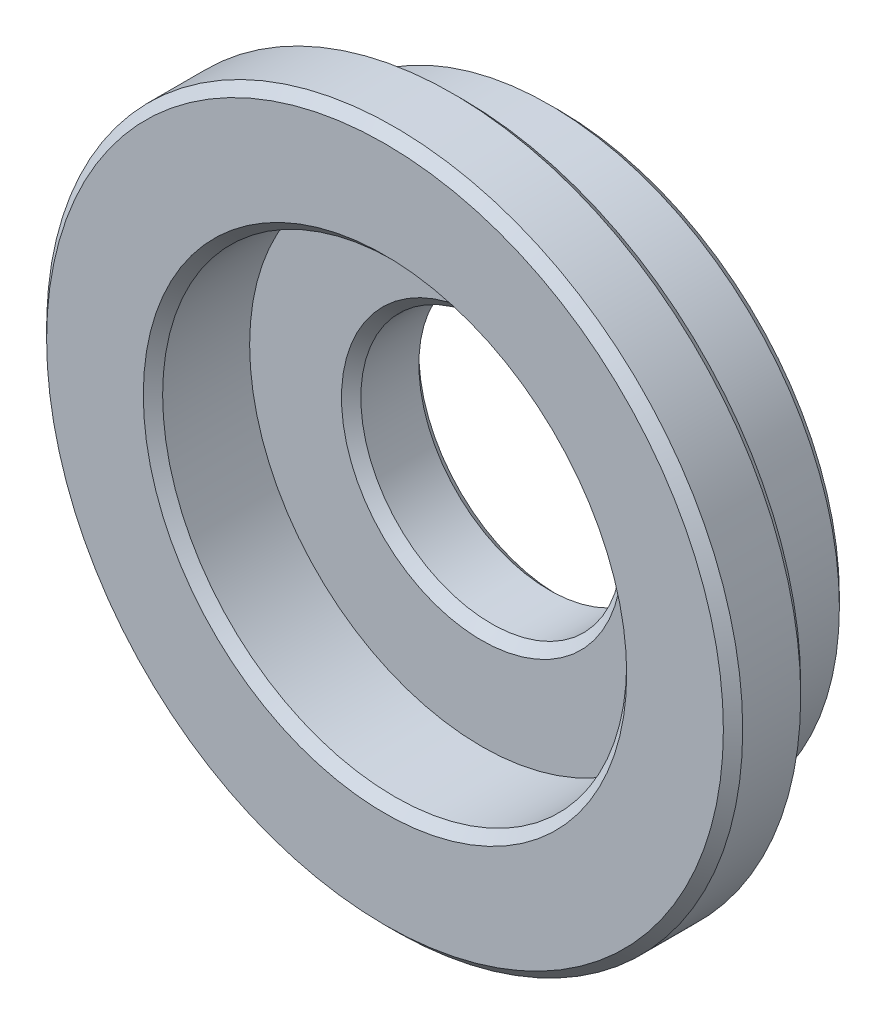
ISO-10303-21;
HEADER;
FILE_DESCRIPTION(('STEP AP214'),'2;1');
FILE_NAME('part.step','',(''),(''),'','','');
FILE_SCHEMA(('AUTOMOTIVE_DESIGN { 1 0 10303 214 1 1 1 1 }'));
ENDSEC;
DATA;
#1=APPLICATION_CONTEXT('core data for automotive mechanical design processes');
#2=APPLICATION_PROTOCOL_DEFINITION('international standard','automotive_design',2000,#1);
#3=PRODUCT_CONTEXT('',#1,'mechanical');
#4=PRODUCT('Part','Part','',(#3));
#5=PRODUCT_RELATED_PRODUCT_CATEGORY('part','',(#4));
#6=PRODUCT_DEFINITION_FORMATION('','',#4);
#7=PRODUCT_DEFINITION_CONTEXT('part definition',#1,'design');
#8=PRODUCT_DEFINITION('design','',#6,#7);
#9=PRODUCT_DEFINITION_SHAPE('','',#8);
#10=(LENGTH_UNIT() NAMED_UNIT(*) SI_UNIT(.MILLI.,.METRE.));
#11=(NAMED_UNIT(*) PLANE_ANGLE_UNIT() SI_UNIT($,.RADIAN.));
#12=(NAMED_UNIT(*) SI_UNIT($,.STERADIAN.) SOLID_ANGLE_UNIT());
#13=UNCERTAINTY_MEASURE_WITH_UNIT(LENGTH_MEASURE(1.E-05),#10,'distance_accuracy_value','');
#14=(GEOMETRIC_REPRESENTATION_CONTEXT(3) GLOBAL_UNCERTAINTY_ASSIGNED_CONTEXT((#13)) GLOBAL_UNIT_ASSIGNED_CONTEXT((#10,
#11,#12)) REPRESENTATION_CONTEXT('',''));
#15=CARTESIAN_POINT('',(0.,0.,0.));
#16=DIRECTION('',(0.,0.,1.));
#17=DIRECTION('',(1.,0.,0.));
#18=AXIS2_PLACEMENT_3D('',#15,#16,#17);
#19=CARTESIAN_POINT('',(0.,0.,0.699999999985221));
#20=DIRECTION('',(0.,0.,1.));
#21=DIRECTION('',(1.,0.,0.));
#22=AXIS2_PLACEMENT_3D('',#19,#20,#21);
#23=CONICAL_SURFACE('',#22,2.40000000000814,0.785398163397447);
#24=CARTESIAN_POINT('',(0.,0.,0.800000000025785));
#25=DIRECTION('',(0.,0.,1.));
#26=DIRECTION('',(1.,0.,0.));
#27=AXIS2_PLACEMENT_3D('',#24,#25,#26);
#28=CIRCLE('',#27,2.5000000000487);
#29=CARTESIAN_POINT('',(2.5000000000487,0.,0.800000000025785));
#30=VERTEX_POINT('',#29);
#31=EDGE_CURVE('E10',#30,#30,#28,.T.);
#32=ORIENTED_EDGE('',*,*,#31,.T.);
#33=EDGE_LOOP('',(#32));
#34=FACE_BOUND('',#33,.T.);
#35=CARTESIAN_POINT('',(0.,0.,0.699999999985221));
#36=DIRECTION('',(0.,0.,1.));
#37=DIRECTION('',(1.,0.,0.));
#38=AXIS2_PLACEMENT_3D('',#35,#36,#37);
#39=CIRCLE('',#38,2.40000000000814);
#40=CARTESIAN_POINT('',(2.40000000000814,0.,0.699999999985221));
#41=VERTEX_POINT('',#40);
#42=EDGE_CURVE('E78',#41,#41,#39,.T.);
#43=ORIENTED_EDGE('',*,*,#42,.F.);
#44=EDGE_LOOP('',(#43));
#45=FACE_BOUND('',#44,.T.);
#46=ADVANCED_FACE('F32',(#34,#45),#23,.F.);
#47=CARTESIAN_POINT('',(2.5000000000487,0.,0.800000000025785));
#48=DIRECTION('',(0.,0.,1.));
#49=DIRECTION('',(1.,0.,0.));
#50=AXIS2_PLACEMENT_3D('',#47,#48,#49);
#51=PLANE('',#50);
#52=CARTESIAN_POINT('',(0.,0.,0.800000000025785));
#53=DIRECTION('',(0.,0.,1.));
#54=DIRECTION('',(1.,0.,0.));
#55=AXIS2_PLACEMENT_3D('',#52,#53,#54);
#56=CIRCLE('',#55,3.49999999996821);
#57=CARTESIAN_POINT('',(3.49999999996821,0.,0.800000000025785));
#58=VERTEX_POINT('',#57);
#59=EDGE_CURVE('E38',#58,#58,#56,.T.);
#60=ORIENTED_EDGE('',*,*,#59,.T.);
#61=EDGE_LOOP('',(#60));
#62=FACE_BOUND('',#61,.T.);
#63=ORIENTED_EDGE('',*,*,#31,.F.);
#64=EDGE_LOOP('',(#63));
#65=FACE_BOUND('',#64,.T.);
#66=ADVANCED_FACE('F86',(#62,#65),#51,.T.);
#67=CARTESIAN_POINT('',(0.,0.,0.800000000025785));
#68=DIRECTION('',(0.,0.,-1.));
#69=DIRECTION('',(-1.,0.,0.));
#70=AXIS2_PLACEMENT_3D('',#67,#68,#69);
#71=CONICAL_SURFACE('',#70,3.49999999996821,0.785398163397449);
#72=CARTESIAN_POINT('',(0.,0.,0.699999999999546));
#73=DIRECTION('',(0.,0.,1.));
#74=DIRECTION('',(1.,0.,0.));
#75=AXIS2_PLACEMENT_3D('',#72,#73,#74);
#76=CIRCLE('',#75,3.59999999999445);
#77=CARTESIAN_POINT('',(3.59999999999445,0.,0.699999999999546));
#78=VERTEX_POINT('',#77);
#79=EDGE_CURVE('E42',#78,#78,#76,.T.);
#80=ORIENTED_EDGE('',*,*,#79,.T.);
#81=EDGE_LOOP('',(#80));
#82=FACE_BOUND('',#81,.T.);
#83=ORIENTED_EDGE('',*,*,#59,.F.);
#84=EDGE_LOOP('',(#83));
#85=FACE_BOUND('',#84,.T.);
#86=ADVANCED_FACE('F90',(#82,#85),#71,.T.);
#87=CARTESIAN_POINT('',(0.,0.,-1.));
#88=DIRECTION('',(0.,0.,1.));
#89=DIRECTION('',(1.,0.,0.));
#90=AXIS2_PLACEMENT_3D('',#87,#88,#89);
#91=CYLINDRICAL_SURFACE('',#90,3.59999999999445);
#92=CARTESIAN_POINT('',(0.,0.,0.100000000031287));
#93=DIRECTION('',(0.,0.,1.));
#94=DIRECTION('',(1.,0.,0.));
#95=AXIS2_PLACEMENT_3D('',#92,#93,#94);
#96=CIRCLE('',#95,3.59999999999445);
#97=CARTESIAN_POINT('',(3.59999999999445,0.,0.100000000031287));
#98=VERTEX_POINT('',#97);
#99=EDGE_CURVE('E46',#98,#98,#96,.T.);
#100=ORIENTED_EDGE('',*,*,#99,.T.);
#101=EDGE_LOOP('',(#100));
#102=FACE_BOUND('',#101,.T.);
#103=ORIENTED_EDGE('',*,*,#79,.F.);
#104=EDGE_LOOP('',(#103));
#105=FACE_BOUND('',#104,.T.);
#106=ADVANCED_FACE('F94',(#102,#105),#91,.T.);
#107=CARTESIAN_POINT('',(0.,0.,0.100000000031287));
#108=DIRECTION('',(0.,0.,1.));
#109=DIRECTION('',(1.,0.,0.));
#110=AXIS2_PLACEMENT_3D('',#107,#108,#109);
#111=CONICAL_SURFACE('',#110,3.59999999999445,0.785398163397448);
#112=CARTESIAN_POINT('',(0.,0.,2.79672118796981E-11));
#113=DIRECTION('',(0.,0.,1.));
#114=DIRECTION('',(1.,0.,0.));
#115=AXIS2_PLACEMENT_3D('',#112,#113,#114);
#116=CIRCLE('',#115,3.49999999999113);
#117=CARTESIAN_POINT('',(3.49999999999113,0.,2.79672118796981E-11));
#118=VERTEX_POINT('',#117);
#119=EDGE_CURVE('E51',#118,#118,#116,.T.);
#120=ORIENTED_EDGE('',*,*,#119,.T.);
#121=EDGE_LOOP('',(#120));
#122=FACE_BOUND('',#121,.T.);
#123=ORIENTED_EDGE('',*,*,#99,.F.);
#124=EDGE_LOOP('',(#123));
#125=FACE_BOUND('',#124,.T.);
#126=ADVANCED_FACE('F101',(#122,#125),#111,.T.);
#127=CARTESIAN_POINT('',(3.49999999999113,0.,2.79673291979469E-11));
#128=DIRECTION('',(0.,0.,-1.));
#129=DIRECTION('',(-1.,0.,0.));
#130=AXIS2_PLACEMENT_3D('',#127,#128,#129);
#131=PLANE('',#130);
#132=CARTESIAN_POINT('',(0.,0.,2.79674287201326E-11));
#133=DIRECTION('',(0.,0.,1.));
#134=DIRECTION('',(1.,0.,0.));
#135=AXIS2_PLACEMENT_3D('',#132,#133,#134);
#136=CIRCLE('',#135,3.00000000001214);
#137=CARTESIAN_POINT('',(3.00000000001214,0.,2.79674287201326E-11));
#138=VERTEX_POINT('',#137);
#139=EDGE_CURVE('E54',#138,#138,#136,.T.);
#140=ORIENTED_EDGE('',*,*,#139,.T.);
#141=EDGE_LOOP('',(#140));
#142=FACE_BOUND('',#141,.T.);
#143=ORIENTED_EDGE('',*,*,#119,.F.);
#144=EDGE_LOOP('',(#143));
#145=FACE_BOUND('',#144,.T.);
#146=ADVANCED_FACE('F105',(#142,#145),#131,.T.);
#147=CARTESIAN_POINT('',(0.,0.,-1.));
#148=DIRECTION('',(0.,0.,1.));
#149=DIRECTION('',(1.,0.,0.));
#150=AXIS2_PLACEMENT_3D('',#147,#148,#149);
#151=CYLINDRICAL_SURFACE('',#150,3.00000000001214);
#152=CARTESIAN_POINT('',(0.,0.,-0.899999999973034));
#153=DIRECTION('',(0.,0.,1.));
#154=DIRECTION('',(1.,0.,0.));
#155=AXIS2_PLACEMENT_3D('',#152,#153,#154);
#156=CIRCLE('',#155,3.00000000001214);
#157=CARTESIAN_POINT('',(3.00000000001214,0.,-0.899999999973034));
#158=VERTEX_POINT('',#157);
#159=EDGE_CURVE('E57',#158,#158,#156,.T.);
#160=ORIENTED_EDGE('',*,*,#159,.T.);
#161=EDGE_LOOP('',(#160));
#162=FACE_BOUND('',#161,.T.);
#163=ORIENTED_EDGE('',*,*,#139,.F.);
#164=EDGE_LOOP('',(#163));
#165=FACE_BOUND('',#164,.T.);
#166=ADVANCED_FACE('F109',(#162,#165),#151,.T.);
#167=CARTESIAN_POINT('',(0.,0.,-0.899999999973034));
#168=DIRECTION('',(0.,0.,1.));
#169=DIRECTION('',(1.,0.,0.));
#170=AXIS2_PLACEMENT_3D('',#167,#168,#169);
#171=CONICAL_SURFACE('',#170,3.00000000001214,0.785398163397449);
#172=CARTESIAN_POINT('',(0.,0.,-0.999999999976353));
#173=DIRECTION('',(0.,0.,1.));
#174=DIRECTION('',(1.,0.,0.));
#175=AXIS2_PLACEMENT_3D('',#172,#173,#174);
#176=CIRCLE('',#175,2.90000000000882);
#177=CARTESIAN_POINT('',(2.90000000000882,0.,-0.999999999976353));
#178=VERTEX_POINT('',#177);
#179=EDGE_CURVE('E60',#178,#178,#176,.T.);
#180=ORIENTED_EDGE('',*,*,#179,.T.);
#181=EDGE_LOOP('',(#180));
#182=FACE_BOUND('',#181,.T.);
#183=ORIENTED_EDGE('',*,*,#159,.F.);
#184=EDGE_LOOP('',(#183));
#185=FACE_BOUND('',#184,.T.);
#186=ADVANCED_FACE('F113',(#182,#185),#171,.T.);
#187=CARTESIAN_POINT('',(2.90000000000882,0.,-0.999999999976353));
#188=DIRECTION('',(0.,0.,-1.));
#189=DIRECTION('',(-1.,0.,0.));
#190=AXIS2_PLACEMENT_3D('',#187,#188,#189);
#191=PLANE('',#190);
#192=CARTESIAN_POINT('',(0.,0.,-0.999999999976353));
#193=DIRECTION('',(0.,0.,1.));
#194=DIRECTION('',(1.,0.,0.));
#195=AXIS2_PLACEMENT_3D('',#192,#193,#194);
#196=CIRCLE('',#195,1.4499999999749);
#197=CARTESIAN_POINT('',(1.4499999999749,0.,-0.999999999976353));
#198=VERTEX_POINT('',#197);
#199=EDGE_CURVE('E63',#198,#198,#196,.T.);
#200=ORIENTED_EDGE('',*,*,#199,.T.);
#201=EDGE_LOOP('',(#200));
#202=FACE_BOUND('',#201,.T.);
#203=ORIENTED_EDGE('',*,*,#179,.F.);
#204=EDGE_LOOP('',(#203));
#205=FACE_BOUND('',#204,.T.);
#206=ADVANCED_FACE('F117',(#202,#205),#191,.T.);
#207=CARTESIAN_POINT('',(0.,0.,-0.999999999976353));
#208=DIRECTION('',(0.,0.,-1.));
#209=DIRECTION('',(-1.,0.,0.));
#210=AXIS2_PLACEMENT_3D('',#207,#208,#209);
#211=CONICAL_SURFACE('',#210,1.4499999999749,0.785398163397448);
#212=CARTESIAN_POINT('',(0.,0.,-0.900000000001455));
#213=DIRECTION('',(0.,0.,1.));
#214=DIRECTION('',(1.,0.,0.));
#215=AXIS2_PLACEMENT_3D('',#212,#213,#214);
#216=CIRCLE('',#215,1.35);
#217=CARTESIAN_POINT('',(1.35,0.,-0.900000000001455));
#218=VERTEX_POINT('',#217);
#219=EDGE_CURVE('E66',#218,#218,#216,.T.);
#220=ORIENTED_EDGE('',*,*,#219,.T.);
#221=EDGE_LOOP('',(#220));
#222=FACE_BOUND('',#221,.T.);
#223=ORIENTED_EDGE('',*,*,#199,.F.);
#224=EDGE_LOOP('',(#223));
#225=FACE_BOUND('',#224,.T.);
#226=ADVANCED_FACE('F121',(#222,#225),#211,.F.);
#227=CARTESIAN_POINT('',(0.,0.,-1.));
#228=DIRECTION('',(0.,0.,1.));
#229=DIRECTION('',(1.,0.,0.));
#230=AXIS2_PLACEMENT_3D('',#227,#228,#229);
#231=CYLINDRICAL_SURFACE('',#230,1.35);
#232=CARTESIAN_POINT('',(0.,0.,-0.3));
#233=DIRECTION('',(0.,0.,1.));
#234=DIRECTION('',(1.,0.,0.));
#235=AXIS2_PLACEMENT_3D('',#232,#233,#234);
#236=CIRCLE('',#235,1.35);
#237=CARTESIAN_POINT('',(1.35,0.,-0.3));
#238=VERTEX_POINT('',#237);
#239=EDGE_CURVE('E69',#238,#238,#236,.T.);
#240=ORIENTED_EDGE('',*,*,#239,.T.);
#241=EDGE_LOOP('',(#240));
#242=FACE_BOUND('',#241,.T.);
#243=ORIENTED_EDGE('',*,*,#219,.F.);
#244=EDGE_LOOP('',(#243));
#245=FACE_BOUND('',#244,.T.);
#246=ADVANCED_FACE('F125',(#242,#245),#231,.F.);
#247=CARTESIAN_POINT('',(0.,0.,-0.3));
#248=DIRECTION('',(0.,0.,1.));
#249=DIRECTION('',(1.,0.,0.));
#250=AXIS2_PLACEMENT_3D('',#247,#248,#249);
#251=CONICAL_SURFACE('',#250,1.35,0.785398163397448);
#252=CARTESIAN_POINT('',(0.,0.,-0.200000000014779));
#253=DIRECTION('',(0.,0.,1.));
#254=DIRECTION('',(1.,0.,0.));
#255=AXIS2_PLACEMENT_3D('',#252,#253,#254);
#256=CIRCLE('',#255,1.44999999998522);
#257=CARTESIAN_POINT('',(1.44999999998522,0.,-0.200000000014779));
#258=VERTEX_POINT('',#257);
#259=EDGE_CURVE('E72',#258,#258,#256,.T.);
#260=ORIENTED_EDGE('',*,*,#259,.T.);
#261=EDGE_LOOP('',(#260));
#262=FACE_BOUND('',#261,.T.);
#263=ORIENTED_EDGE('',*,*,#239,.F.);
#264=EDGE_LOOP('',(#263));
#265=FACE_BOUND('',#264,.T.);
#266=ADVANCED_FACE('F129',(#262,#265),#251,.F.);
#267=CARTESIAN_POINT('',(1.44999999998522,0.,-0.200000000014779));
#268=DIRECTION('',(0.,0.,1.));
#269=DIRECTION('',(1.,0.,0.));
#270=AXIS2_PLACEMENT_3D('',#267,#268,#269);
#271=PLANE('',#270);
#272=CARTESIAN_POINT('',(0.,0.,-0.200000000014779));
#273=DIRECTION('',(0.,0.,1.));
#274=DIRECTION('',(1.,0.,0.));
#275=AXIS2_PLACEMENT_3D('',#272,#273,#274);
#276=CIRCLE('',#275,2.40000000000814);
#277=CARTESIAN_POINT('',(2.40000000000814,0.,-0.200000000014779));
#278=VERTEX_POINT('',#277);
#279=EDGE_CURVE('E75',#278,#278,#276,.T.);
#280=ORIENTED_EDGE('',*,*,#279,.T.);
#281=EDGE_LOOP('',(#280));
#282=FACE_BOUND('',#281,.T.);
#283=ORIENTED_EDGE('',*,*,#259,.F.);
#284=EDGE_LOOP('',(#283));
#285=FACE_BOUND('',#284,.T.);
#286=ADVANCED_FACE('F133',(#282,#285),#271,.T.);
#287=CARTESIAN_POINT('',(0.,0.,-1.));
#288=DIRECTION('',(0.,0.,1.));
#289=DIRECTION('',(1.,0.,0.));
#290=AXIS2_PLACEMENT_3D('',#287,#288,#289);
#291=CYLINDRICAL_SURFACE('',#290,2.40000000000814);
#292=ORIENTED_EDGE('',*,*,#42,.T.);
#293=EDGE_LOOP('',(#292));
#294=FACE_BOUND('',#293,.T.);
#295=ORIENTED_EDGE('',*,*,#279,.F.);
#296=EDGE_LOOP('',(#295));
#297=FACE_BOUND('',#296,.T.);
#298=ADVANCED_FACE('F82',(#294,#297),#291,.F.);
#299=CLOSED_SHELL('',(#46,#66,#86,#106,#126,#146,#166,#186,#206,#226,#246,#266,#286,#298));
#300=MANIFOLD_SOLID_BREP('B2',#299);
#301=ADVANCED_BREP_SHAPE_REPRESENTATION('',(#18,#300),#14);
#302=SHAPE_DEFINITION_REPRESENTATION(#9,#301);
ENDSEC;
END-ISO-10303-21;
